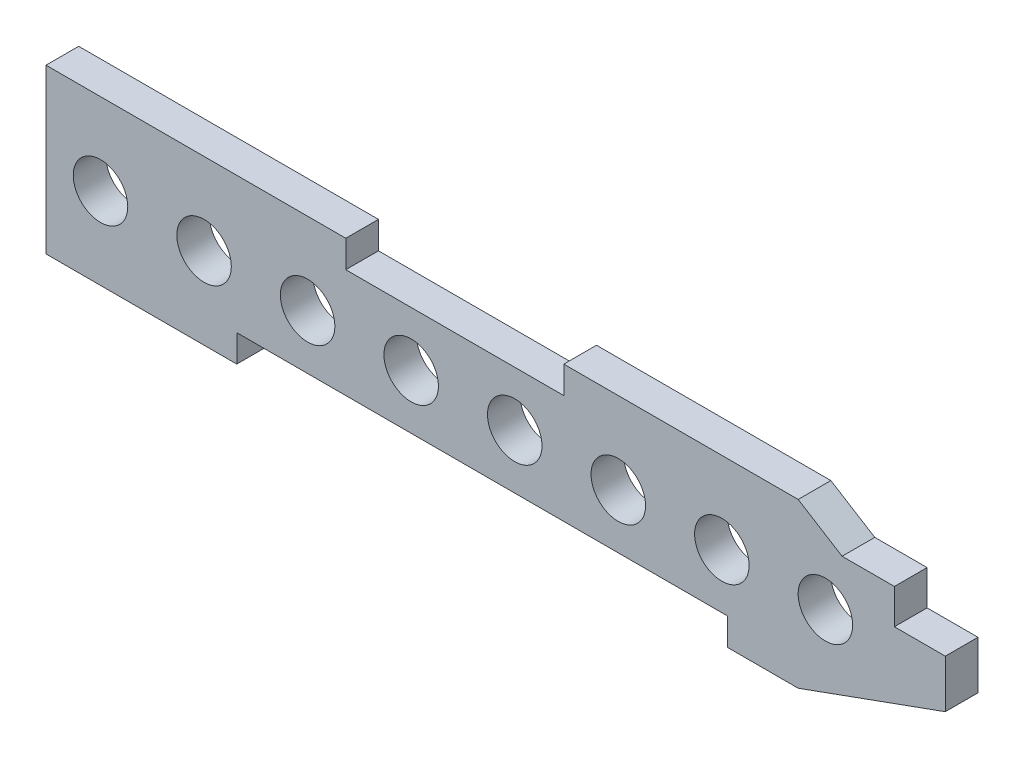
ISO-10303-21;
HEADER;
FILE_DESCRIPTION(('STEP AP214'),'2;1');
FILE_NAME('part.step','',(''),(''),'','','');
FILE_SCHEMA(('AUTOMOTIVE_DESIGN { 1 0 10303 214 1 1 1 1 }'));
ENDSEC;
DATA;
#1=APPLICATION_CONTEXT('core data for automotive mechanical design processes');
#2=APPLICATION_PROTOCOL_DEFINITION('international standard','automotive_design',2000,#1);
#3=PRODUCT_CONTEXT('',#1,'mechanical');
#4=PRODUCT('Part','Part','',(#3));
#5=PRODUCT_RELATED_PRODUCT_CATEGORY('part','',(#4));
#6=PRODUCT_DEFINITION_FORMATION('','',#4);
#7=PRODUCT_DEFINITION_CONTEXT('part definition',#1,'design');
#8=PRODUCT_DEFINITION('design','',#6,#7);
#9=PRODUCT_DEFINITION_SHAPE('','',#8);
#10=(LENGTH_UNIT() NAMED_UNIT(*) SI_UNIT(.MILLI.,.METRE.));
#11=(NAMED_UNIT(*) PLANE_ANGLE_UNIT() SI_UNIT($,.RADIAN.));
#12=(NAMED_UNIT(*) SI_UNIT($,.STERADIAN.) SOLID_ANGLE_UNIT());
#13=UNCERTAINTY_MEASURE_WITH_UNIT(LENGTH_MEASURE(1.E-05),#10,'distance_accuracy_value','');
#14=(GEOMETRIC_REPRESENTATION_CONTEXT(3) GLOBAL_UNCERTAINTY_ASSIGNED_CONTEXT((#13)) GLOBAL_UNIT_ASSIGNED_CONTEXT((#10,
#11,#12)) REPRESENTATION_CONTEXT('',''));
#15=CARTESIAN_POINT('',(0.,0.,0.));
#16=DIRECTION('',(0.,0.,1.));
#17=DIRECTION('',(1.,0.,0.));
#18=AXIS2_PLACEMENT_3D('',#15,#16,#17);
#19=CARTESIAN_POINT('',(0.,0.,12.));
#20=DIRECTION('',(0.,0.,1.));
#21=DIRECTION('',(1.,0.,0.));
#22=AXIS2_PLACEMENT_3D('',#19,#20,#21);
#23=PLANE('',#22);
#24=CARTESIAN_POINT('',(50.196997967068,5.87576447779662,12.));
#25=DIRECTION('',(0.,0.,1.));
#26=DIRECTION('',(1.,0.,0.));
#27=AXIS2_PLACEMENT_3D('',#24,#25,#26);
#28=CIRCLE('',#27,10.);
#29=CARTESIAN_POINT('',(60.196997967068,5.87576447779662,12.));
#30=VERTEX_POINT('',#29);
#31=EDGE_CURVE('E428',#30,#30,#28,.T.);
#32=ORIENTED_EDGE('',*,*,#31,.F.);
#33=EDGE_LOOP('',(#32));
#34=FACE_BOUND('',#33,.T.);
#35=CARTESIAN_POINT('',(-25.803002032932,5.87576447779662,12.));
#36=DIRECTION('',(0.,0.,1.));
#37=DIRECTION('',(1.,0.,0.));
#38=AXIS2_PLACEMENT_3D('',#35,#36,#37);
#39=CIRCLE('',#38,10.);
#40=CARTESIAN_POINT('',(-15.8030020329319,5.87576447779662,12.));
#41=VERTEX_POINT('',#40);
#42=EDGE_CURVE('E444',#41,#41,#39,.T.);
#43=ORIENTED_EDGE('',*,*,#42,.F.);
#44=EDGE_LOOP('',(#43));
#45=FACE_BOUND('',#44,.T.);
#46=CARTESIAN_POINT('',(-101.803002032932,5.87576447779662,12.));
#47=DIRECTION('',(0.,0.,1.));
#48=DIRECTION('',(1.,0.,0.));
#49=AXIS2_PLACEMENT_3D('',#46,#47,#48);
#50=CIRCLE('',#49,10.);
#51=CARTESIAN_POINT('',(-91.8030020329319,5.87576447779662,12.));
#52=VERTEX_POINT('',#51);
#53=EDGE_CURVE('E460',#52,#52,#50,.T.);
#54=ORIENTED_EDGE('',*,*,#53,.F.);
#55=EDGE_LOOP('',(#54));
#56=FACE_BOUND('',#55,.T.);
#57=CARTESIAN_POINT('',(-177.803002032932,5.87576447779662,12.));
#58=DIRECTION('',(0.,0.,1.));
#59=DIRECTION('',(1.,0.,0.));
#60=AXIS2_PLACEMENT_3D('',#57,#58,#59);
#61=CIRCLE('',#60,10.);
#62=CARTESIAN_POINT('',(-167.803002032932,5.87576447779662,12.));
#63=VERTEX_POINT('',#62);
#64=EDGE_CURVE('E200',#63,#63,#61,.T.);
#65=ORIENTED_EDGE('',*,*,#64,.F.);
#66=EDGE_LOOP('',(#65));
#67=FACE_BOUND('',#66,.T.);
#68=DIRECTION('',(1.,0.,0.));
#69=VECTOR('',#68,1.);
#70=CARTESIAN_POINT('',(-197.803002032932,-24.1242355222034,12.));
#71=LINE('',#70,#69);
#72=CARTESIAN_POINT('',(-197.803002032932,-24.1242355222034,12.));
#73=VERTEX_POINT('',#72);
#74=CARTESIAN_POINT('',(-127.803002032932,-24.1242355222034,12.));
#75=VERTEX_POINT('',#74);
#76=EDGE_CURVE('E245',#73,#75,#71,.T.);
#77=ORIENTED_EDGE('',*,*,#76,.T.);
#78=DIRECTION('',(0.,1.,0.));
#79=VECTOR('',#78,1.);
#80=CARTESIAN_POINT('',(-127.803002032932,-24.1242355222034,12.));
#81=LINE('',#80,#79);
#82=CARTESIAN_POINT('',(-127.803002032932,-14.1242355222034,12.));
#83=VERTEX_POINT('',#82);
#84=EDGE_CURVE('E127',#75,#83,#81,.T.);
#85=ORIENTED_EDGE('',*,*,#84,.T.);
#86=DIRECTION('',(1.,0.,0.));
#87=VECTOR('',#86,1.);
#88=CARTESIAN_POINT('',(-127.803002032932,-14.1242355222034,12.));
#89=LINE('',#88,#87);
#90=CARTESIAN_POINT('',(52.1969979670681,-14.1242355222034,12.));
#91=VERTEX_POINT('',#90);
#92=EDGE_CURVE('E302',#83,#91,#89,.T.);
#93=ORIENTED_EDGE('',*,*,#92,.T.);
#94=DIRECTION('',(0.,-1.,0.));
#95=VECTOR('',#94,1.);
#96=CARTESIAN_POINT('',(52.1969979670681,-14.1242355222034,12.));
#97=LINE('',#96,#95);
#98=CARTESIAN_POINT('',(52.1969979670681,-24.1242355222034,12.));
#99=VERTEX_POINT('',#98);
#100=EDGE_CURVE('E322',#91,#99,#97,.T.);
#101=ORIENTED_EDGE('',*,*,#100,.T.);
#102=DIRECTION('',(1.,0.,0.));
#103=VECTOR('',#102,1.);
#104=CARTESIAN_POINT('',(52.1969979670681,-24.1242355222034,12.));
#105=LINE('',#104,#103);
#106=CARTESIAN_POINT('',(78.2069979670681,-24.1242355222034,12.));
#107=VERTEX_POINT('',#106);
#108=EDGE_CURVE('E318',#99,#107,#105,.T.);
#109=ORIENTED_EDGE('',*,*,#108,.T.);
#110=DIRECTION('',(0.940366742720057,0.340162298301958,0.));
#111=VECTOR('',#110,1.);
#112=CARTESIAN_POINT('',(78.2069979670681,-24.1242355222034,12.));
#113=LINE('',#112,#111);
#114=CARTESIAN_POINT('',(132.196997967068,-4.59423552220335,12.));
#115=VERTEX_POINT('',#114);
#116=EDGE_CURVE('E321',#107,#115,#113,.T.);
#117=ORIENTED_EDGE('',*,*,#116,.T.);
#118=DIRECTION('',(0.,1.,0.));
#119=VECTOR('',#118,1.);
#120=CARTESIAN_POINT('',(132.196997967068,-4.59423552220335,12.));
#121=LINE('',#120,#119);
#122=CARTESIAN_POINT('',(132.196997967068,13.0657644777966,12.));
#123=VERTEX_POINT('',#122);
#124=EDGE_CURVE('E326',#115,#123,#121,.T.);
#125=ORIENTED_EDGE('',*,*,#124,.T.);
#126=DIRECTION('',(-1.,0.,0.));
#127=VECTOR('',#126,1.);
#128=CARTESIAN_POINT('',(132.196997967068,13.0657644777966,12.));
#129=LINE('',#128,#127);
#130=CARTESIAN_POINT('',(113.516997967068,13.0657644777966,12.));
#131=VERTEX_POINT('',#130);
#132=EDGE_CURVE('E333',#123,#131,#129,.T.);
#133=ORIENTED_EDGE('',*,*,#132,.T.);
#134=DIRECTION('',(0.,1.,0.));
#135=VECTOR('',#134,1.);
#136=CARTESIAN_POINT('',(113.516997967068,13.0657644777966,12.));
#137=LINE('',#136,#135);
#138=CARTESIAN_POINT('',(113.516997967068,25.8757644777966,12.));
#139=VERTEX_POINT('',#138);
#140=EDGE_CURVE('E336',#131,#139,#137,.T.);
#141=ORIENTED_EDGE('',*,*,#140,.T.);
#142=DIRECTION('',(-1.,0.,0.));
#143=VECTOR('',#142,1.);
#144=CARTESIAN_POINT('',(113.516997967068,25.8757644777966,12.));
#145=LINE('',#144,#143);
#146=CARTESIAN_POINT('',(94.3169979670681,25.8757644777966,12.));
#147=VERTEX_POINT('',#146);
#148=EDGE_CURVE('E339',#139,#147,#145,.T.);
#149=ORIENTED_EDGE('',*,*,#148,.T.);
#150=DIRECTION('',(-0.849623868789641,0.52738911780859,0.));
#151=VECTOR('',#150,1.);
#152=CARTESIAN_POINT('',(94.3169979670681,25.8757644777966,12.));
#153=LINE('',#152,#151);
#154=CARTESIAN_POINT('',(78.206997967068,35.8757644777966,12.));
#155=VERTEX_POINT('',#154);
#156=EDGE_CURVE('E342',#147,#155,#153,.T.);
#157=ORIENTED_EDGE('',*,*,#156,.T.);
#158=DIRECTION('',(-1.,0.,0.));
#159=VECTOR('',#158,1.);
#160=CARTESIAN_POINT('',(78.206997967068,35.8757644777966,12.));
#161=LINE('',#160,#159);
#162=CARTESIAN_POINT('',(-7.80300203293197,35.8757644777966,12.));
#163=VERTEX_POINT('',#162);
#164=EDGE_CURVE('E345',#155,#163,#161,.T.);
#165=ORIENTED_EDGE('',*,*,#164,.T.);
#166=DIRECTION('',(0.,-1.,0.));
#167=VECTOR('',#166,1.);
#168=CARTESIAN_POINT('',(-7.80300203293197,35.8757644777966,12.));
#169=LINE('',#168,#167);
#170=CARTESIAN_POINT('',(-7.80300203293197,25.8757644777966,12.));
#171=VERTEX_POINT('',#170);
#172=EDGE_CURVE('E348',#163,#171,#169,.T.);
#173=ORIENTED_EDGE('',*,*,#172,.T.);
#174=DIRECTION('',(-1.,0.,0.));
#175=VECTOR('',#174,1.);
#176=CARTESIAN_POINT('',(-7.80300203293197,25.8757644777966,12.));
#177=LINE('',#176,#175);
#178=CARTESIAN_POINT('',(-87.803002032932,25.8757644777966,12.));
#179=VERTEX_POINT('',#178);
#180=EDGE_CURVE('E173',#171,#179,#177,.T.);
#181=ORIENTED_EDGE('',*,*,#180,.T.);
#182=DIRECTION('',(0.,1.,0.));
#183=VECTOR('',#182,1.);
#184=CARTESIAN_POINT('',(-87.803002032932,25.8757644777966,12.));
#185=LINE('',#184,#183);
#186=CARTESIAN_POINT('',(-87.803002032932,35.8757644777966,12.));
#187=VERTEX_POINT('',#186);
#188=EDGE_CURVE('E167',#179,#187,#185,.T.);
#189=ORIENTED_EDGE('',*,*,#188,.T.);
#190=DIRECTION('',(-1.,0.,0.));
#191=VECTOR('',#190,1.);
#192=CARTESIAN_POINT('',(-87.803002032932,35.8757644777966,12.));
#193=LINE('',#192,#191);
#194=CARTESIAN_POINT('',(-197.803002032932,35.8757644777966,12.));
#195=VERTEX_POINT('',#194);
#196=EDGE_CURVE('E171',#187,#195,#193,.T.);
#197=ORIENTED_EDGE('',*,*,#196,.T.);
#198=DIRECTION('',(0.,-1.,0.));
#199=VECTOR('',#198,1.);
#200=CARTESIAN_POINT('',(-197.803002032932,35.8757644777966,12.));
#201=LINE('',#200,#199);
#202=EDGE_CURVE('E57',#195,#73,#201,.T.);
#203=ORIENTED_EDGE('',*,*,#202,.T.);
#204=EDGE_LOOP('',(#77,#85,#93,#101,#109,#117,#125,#133,#141,#149,#157,#165,#173,#181,#189,#197,#203));
#205=FACE_BOUND('',#204,.T.);
#206=CARTESIAN_POINT('',(-139.803002032932,5.87576447779662,12.));
#207=DIRECTION('',(0.,0.,1.));
#208=DIRECTION('',(1.,0.,0.));
#209=AXIS2_PLACEMENT_3D('',#206,#207,#208);
#210=CIRCLE('',#209,10.);
#211=CARTESIAN_POINT('',(-129.803002032932,5.87576447779662,12.));
#212=VERTEX_POINT('',#211);
#213=EDGE_CURVE('E468',#212,#212,#210,.T.);
#214=ORIENTED_EDGE('',*,*,#213,.F.);
#215=EDGE_LOOP('',(#214));
#216=FACE_BOUND('',#215,.T.);
#217=CARTESIAN_POINT('',(-63.803002032932,5.87576447779662,12.));
#218=DIRECTION('',(0.,0.,1.));
#219=DIRECTION('',(1.,0.,0.));
#220=AXIS2_PLACEMENT_3D('',#217,#218,#219);
#221=CIRCLE('',#220,10.);
#222=CARTESIAN_POINT('',(-53.8030020329319,5.87576447779662,12.));
#223=VERTEX_POINT('',#222);
#224=EDGE_CURVE('E452',#223,#223,#221,.T.);
#225=ORIENTED_EDGE('',*,*,#224,.F.);
#226=EDGE_LOOP('',(#225));
#227=FACE_BOUND('',#226,.T.);
#228=CARTESIAN_POINT('',(12.1969979670681,5.87576447779662,12.));
#229=DIRECTION('',(0.,0.,1.));
#230=DIRECTION('',(1.,0.,0.));
#231=AXIS2_PLACEMENT_3D('',#228,#229,#230);
#232=CIRCLE('',#231,10.);
#233=CARTESIAN_POINT('',(22.1969979670681,5.87576447779662,12.));
#234=VERTEX_POINT('',#233);
#235=EDGE_CURVE('E436',#234,#234,#232,.T.);
#236=ORIENTED_EDGE('',*,*,#235,.F.);
#237=EDGE_LOOP('',(#236));
#238=FACE_BOUND('',#237,.T.);
#239=CARTESIAN_POINT('',(88.1969979670681,5.87576447779662,12.));
#240=DIRECTION('',(0.,0.,1.));
#241=DIRECTION('',(1.,0.,0.));
#242=AXIS2_PLACEMENT_3D('',#239,#240,#241);
#243=CIRCLE('',#242,10.);
#244=CARTESIAN_POINT('',(98.1969979670681,5.87576447779662,12.));
#245=VERTEX_POINT('',#244);
#246=EDGE_CURVE('E417',#245,#245,#243,.T.);
#247=ORIENTED_EDGE('',*,*,#246,.F.);
#248=EDGE_LOOP('',(#247));
#249=FACE_BOUND('',#248,.T.);
#250=ADVANCED_FACE('F39',(#34,#45,#56,#67,#205,#216,#227,#238,#249),#23,.T.);
#251=CARTESIAN_POINT('',(0.,0.,0.));
#252=DIRECTION('',(0.,0.,1.));
#253=DIRECTION('',(1.,0.,0.));
#254=AXIS2_PLACEMENT_3D('',#251,#252,#253);
#255=PLANE('',#254);
#256=DIRECTION('',(1.,0.,0.));
#257=VECTOR('',#256,1.);
#258=CARTESIAN_POINT('',(-197.803002032932,-24.1242355222034,0.));
#259=LINE('',#258,#257);
#260=CARTESIAN_POINT('',(-197.803002032932,-24.1242355222034,0.));
#261=VERTEX_POINT('',#260);
#262=CARTESIAN_POINT('',(-127.803002032932,-24.1242355222034,0.));
#263=VERTEX_POINT('',#262);
#264=EDGE_CURVE('E195',#261,#263,#259,.T.);
#265=ORIENTED_EDGE('',*,*,#264,.F.);
#266=DIRECTION('',(0.,-1.,0.));
#267=VECTOR('',#266,1.);
#268=CARTESIAN_POINT('',(-197.803002032932,35.8757644777966,0.));
#269=LINE('',#268,#267);
#270=CARTESIAN_POINT('',(-197.803002032932,35.8757644777966,0.));
#271=VERTEX_POINT('',#270);
#272=EDGE_CURVE('E119',#271,#261,#269,.T.);
#273=ORIENTED_EDGE('',*,*,#272,.F.);
#274=DIRECTION('',(-1.,0.,0.));
#275=VECTOR('',#274,1.);
#276=CARTESIAN_POINT('',(-87.803002032932,35.8757644777966,0.));
#277=LINE('',#276,#275);
#278=CARTESIAN_POINT('',(-87.803002032932,35.8757644777966,0.));
#279=VERTEX_POINT('',#278);
#280=EDGE_CURVE('E113',#279,#271,#277,.T.);
#281=ORIENTED_EDGE('',*,*,#280,.F.);
#282=DIRECTION('',(0.,1.,0.));
#283=VECTOR('',#282,1.);
#284=CARTESIAN_POINT('',(-87.803002032932,25.8757644777966,0.));
#285=LINE('',#284,#283);
#286=CARTESIAN_POINT('',(-87.803002032932,25.8757644777966,0.));
#287=VERTEX_POINT('',#286);
#288=EDGE_CURVE('E182',#287,#279,#285,.T.);
#289=ORIENTED_EDGE('',*,*,#288,.F.);
#290=DIRECTION('',(-1.,0.,0.));
#291=VECTOR('',#290,1.);
#292=CARTESIAN_POINT('',(-7.80300203293197,25.8757644777966,0.));
#293=LINE('',#292,#291);
#294=CARTESIAN_POINT('',(-7.80300203293197,25.8757644777966,0.));
#295=VERTEX_POINT('',#294);
#296=EDGE_CURVE('E236',#295,#287,#293,.T.);
#297=ORIENTED_EDGE('',*,*,#296,.F.);
#298=DIRECTION('',(0.,-1.,0.));
#299=VECTOR('',#298,1.);
#300=CARTESIAN_POINT('',(-7.80300203293197,35.8757644777966,0.));
#301=LINE('',#300,#299);
#302=CARTESIAN_POINT('',(-7.80300203293197,35.8757644777966,0.));
#303=VERTEX_POINT('',#302);
#304=EDGE_CURVE('E233',#303,#295,#301,.T.);
#305=ORIENTED_EDGE('',*,*,#304,.F.);
#306=DIRECTION('',(-1.,0.,0.));
#307=VECTOR('',#306,1.);
#308=CARTESIAN_POINT('',(78.206997967068,35.8757644777966,0.));
#309=LINE('',#308,#307);
#310=CARTESIAN_POINT('',(78.206997967068,35.8757644777966,0.));
#311=VERTEX_POINT('',#310);
#312=EDGE_CURVE('E230',#311,#303,#309,.T.);
#313=ORIENTED_EDGE('',*,*,#312,.F.);
#314=DIRECTION('',(-0.849623868789641,0.52738911780859,0.));
#315=VECTOR('',#314,1.);
#316=CARTESIAN_POINT('',(94.3169979670681,25.8757644777966,0.));
#317=LINE('',#316,#315);
#318=CARTESIAN_POINT('',(94.3169979670681,25.8757644777966,0.));
#319=VERTEX_POINT('',#318);
#320=EDGE_CURVE('E227',#319,#311,#317,.T.);
#321=ORIENTED_EDGE('',*,*,#320,.F.);
#322=DIRECTION('',(-1.,0.,0.));
#323=VECTOR('',#322,1.);
#324=CARTESIAN_POINT('',(113.516997967068,25.8757644777966,0.));
#325=LINE('',#324,#323);
#326=CARTESIAN_POINT('',(113.516997967068,25.8757644777966,0.));
#327=VERTEX_POINT('',#326);
#328=EDGE_CURVE('E224',#327,#319,#325,.T.);
#329=ORIENTED_EDGE('',*,*,#328,.F.);
#330=DIRECTION('',(0.,1.,0.));
#331=VECTOR('',#330,1.);
#332=CARTESIAN_POINT('',(113.516997967068,13.0657644777966,0.));
#333=LINE('',#332,#331);
#334=CARTESIAN_POINT('',(113.516997967068,13.0657644777966,0.));
#335=VERTEX_POINT('',#334);
#336=EDGE_CURVE('E221',#335,#327,#333,.T.);
#337=ORIENTED_EDGE('',*,*,#336,.F.);
#338=DIRECTION('',(-1.,0.,0.));
#339=VECTOR('',#338,1.);
#340=CARTESIAN_POINT('',(132.196997967068,13.0657644777966,0.));
#341=LINE('',#340,#339);
#342=CARTESIAN_POINT('',(132.196997967068,13.0657644777966,0.));
#343=VERTEX_POINT('',#342);
#344=EDGE_CURVE('E218',#343,#335,#341,.T.);
#345=ORIENTED_EDGE('',*,*,#344,.F.);
#346=DIRECTION('',(0.,1.,0.));
#347=VECTOR('',#346,1.);
#348=CARTESIAN_POINT('',(132.196997967068,-4.59423552220335,0.));
#349=LINE('',#348,#347);
#350=CARTESIAN_POINT('',(132.196997967068,-4.59423552220335,0.));
#351=VERTEX_POINT('',#350);
#352=EDGE_CURVE('E215',#351,#343,#349,.T.);
#353=ORIENTED_EDGE('',*,*,#352,.F.);
#354=DIRECTION('',(0.940366742720057,0.340162298301958,0.));
#355=VECTOR('',#354,1.);
#356=CARTESIAN_POINT('',(78.2069979670681,-24.1242355222034,0.));
#357=LINE('',#356,#355);
#358=CARTESIAN_POINT('',(78.2069979670681,-24.1242355222034,0.));
#359=VERTEX_POINT('',#358);
#360=EDGE_CURVE('E212',#359,#351,#357,.T.);
#361=ORIENTED_EDGE('',*,*,#360,.F.);
#362=DIRECTION('',(1.,0.,0.));
#363=VECTOR('',#362,1.);
#364=CARTESIAN_POINT('',(52.1969979670681,-24.1242355222034,0.));
#365=LINE('',#364,#363);
#366=CARTESIAN_POINT('',(52.1969979670681,-24.1242355222034,0.));
#367=VERTEX_POINT('',#366);
#368=EDGE_CURVE('E209',#367,#359,#365,.T.);
#369=ORIENTED_EDGE('',*,*,#368,.F.);
#370=DIRECTION('',(0.,-1.,0.));
#371=VECTOR('',#370,1.);
#372=CARTESIAN_POINT('',(52.1969979670681,-14.1242355222034,0.));
#373=LINE('',#372,#371);
#374=CARTESIAN_POINT('',(52.1969979670681,-14.1242355222034,0.));
#375=VERTEX_POINT('',#374);
#376=EDGE_CURVE('E206',#375,#367,#373,.T.);
#377=ORIENTED_EDGE('',*,*,#376,.F.);
#378=DIRECTION('',(1.,0.,0.));
#379=VECTOR('',#378,1.);
#380=CARTESIAN_POINT('',(-127.803002032932,-14.1242355222034,0.));
#381=LINE('',#380,#379);
#382=CARTESIAN_POINT('',(-127.803002032932,-14.1242355222034,0.));
#383=VERTEX_POINT('',#382);
#384=EDGE_CURVE('E203',#383,#375,#381,.T.);
#385=ORIENTED_EDGE('',*,*,#384,.F.);
#386=DIRECTION('',(0.,1.,0.));
#387=VECTOR('',#386,1.);
#388=CARTESIAN_POINT('',(-127.803002032932,-24.1242355222034,0.));
#389=LINE('',#388,#387);
#390=EDGE_CURVE('E199',#263,#383,#389,.T.);
#391=ORIENTED_EDGE('',*,*,#390,.F.);
#392=EDGE_LOOP('',(#265,#273,#281,#289,#297,#305,#313,#321,#329,#337,#345,#353,#361,#369,#377,
#385,#391));
#393=FACE_BOUND('',#392,.T.);
#394=CARTESIAN_POINT('',(-177.803002032932,5.87576447779662,0.));
#395=DIRECTION('',(0.,0.,1.));
#396=DIRECTION('',(1.,0.,0.));
#397=AXIS2_PLACEMENT_3D('',#394,#395,#396);
#398=CIRCLE('',#397,10.);
#399=CARTESIAN_POINT('',(-167.803002032932,5.87576447779662,0.));
#400=VERTEX_POINT('',#399);
#401=EDGE_CURVE('E472',#400,#400,#398,.T.);
#402=ORIENTED_EDGE('',*,*,#401,.T.);
#403=EDGE_LOOP('',(#402));
#404=FACE_BOUND('',#403,.T.);
#405=CARTESIAN_POINT('',(-139.803002032932,5.87576447779662,0.));
#406=DIRECTION('',(0.,0.,1.));
#407=DIRECTION('',(1.,0.,0.));
#408=AXIS2_PLACEMENT_3D('',#405,#406,#407);
#409=CIRCLE('',#408,10.);
#410=CARTESIAN_POINT('',(-129.803002032932,5.87576447779662,0.));
#411=VERTEX_POINT('',#410);
#412=EDGE_CURVE('E464',#411,#411,#409,.T.);
#413=ORIENTED_EDGE('',*,*,#412,.T.);
#414=EDGE_LOOP('',(#413));
#415=FACE_BOUND('',#414,.T.);
#416=CARTESIAN_POINT('',(-101.803002032932,5.87576447779662,0.));
#417=DIRECTION('',(0.,0.,1.));
#418=DIRECTION('',(1.,0.,0.));
#419=AXIS2_PLACEMENT_3D('',#416,#417,#418);
#420=CIRCLE('',#419,10.);
#421=CARTESIAN_POINT('',(-91.8030020329319,5.87576447779662,0.));
#422=VERTEX_POINT('',#421);
#423=EDGE_CURVE('E456',#422,#422,#420,.T.);
#424=ORIENTED_EDGE('',*,*,#423,.T.);
#425=EDGE_LOOP('',(#424));
#426=FACE_BOUND('',#425,.T.);
#427=CARTESIAN_POINT('',(-63.803002032932,5.87576447779662,0.));
#428=DIRECTION('',(0.,0.,1.));
#429=DIRECTION('',(1.,0.,0.));
#430=AXIS2_PLACEMENT_3D('',#427,#428,#429);
#431=CIRCLE('',#430,10.);
#432=CARTESIAN_POINT('',(-53.8030020329319,5.87576447779662,0.));
#433=VERTEX_POINT('',#432);
#434=EDGE_CURVE('E448',#433,#433,#431,.T.);
#435=ORIENTED_EDGE('',*,*,#434,.T.);
#436=EDGE_LOOP('',(#435));
#437=FACE_BOUND('',#436,.T.);
#438=CARTESIAN_POINT('',(-25.803002032932,5.87576447779662,0.));
#439=DIRECTION('',(0.,0.,1.));
#440=DIRECTION('',(1.,0.,0.));
#441=AXIS2_PLACEMENT_3D('',#438,#439,#440);
#442=CIRCLE('',#441,10.);
#443=CARTESIAN_POINT('',(-15.8030020329319,5.87576447779662,0.));
#444=VERTEX_POINT('',#443);
#445=EDGE_CURVE('E440',#444,#444,#442,.T.);
#446=ORIENTED_EDGE('',*,*,#445,.T.);
#447=EDGE_LOOP('',(#446));
#448=FACE_BOUND('',#447,.T.);
#449=CARTESIAN_POINT('',(12.1969979670681,5.87576447779662,0.));
#450=DIRECTION('',(0.,0.,1.));
#451=DIRECTION('',(1.,0.,0.));
#452=AXIS2_PLACEMENT_3D('',#449,#450,#451);
#453=CIRCLE('',#452,10.);
#454=CARTESIAN_POINT('',(22.1969979670681,5.87576447779662,0.));
#455=VERTEX_POINT('',#454);
#456=EDGE_CURVE('E432',#455,#455,#453,.T.);
#457=ORIENTED_EDGE('',*,*,#456,.T.);
#458=EDGE_LOOP('',(#457));
#459=FACE_BOUND('',#458,.T.);
#460=CARTESIAN_POINT('',(50.196997967068,5.87576447779662,0.));
#461=DIRECTION('',(0.,0.,1.));
#462=DIRECTION('',(1.,0.,0.));
#463=AXIS2_PLACEMENT_3D('',#460,#461,#462);
#464=CIRCLE('',#463,10.);
#465=CARTESIAN_POINT('',(60.196997967068,5.87576447779662,0.));
#466=VERTEX_POINT('',#465);
#467=EDGE_CURVE('E425',#466,#466,#464,.T.);
#468=ORIENTED_EDGE('',*,*,#467,.T.);
#469=EDGE_LOOP('',(#468));
#470=FACE_BOUND('',#469,.T.);
#471=CARTESIAN_POINT('',(88.1969979670681,5.87576447779662,0.));
#472=DIRECTION('',(0.,0.,1.));
#473=DIRECTION('',(1.,0.,0.));
#474=AXIS2_PLACEMENT_3D('',#471,#472,#473);
#475=CIRCLE('',#474,10.);
#476=CARTESIAN_POINT('',(98.1969979670681,5.87576447779662,0.));
#477=VERTEX_POINT('',#476);
#478=EDGE_CURVE('E420',#477,#477,#475,.T.);
#479=ORIENTED_EDGE('',*,*,#478,.T.);
#480=EDGE_LOOP('',(#479));
#481=FACE_BOUND('',#480,.T.);
#482=ADVANCED_FACE('F306',(#393,#404,#415,#426,#437,#448,#459,#470,#481),#255,.F.);
#483=CARTESIAN_POINT('',(-197.803002032932,-24.1242355222034,12.));
#484=DIRECTION('',(0.,1.,0.));
#485=DIRECTION('',(-1.,0.,0.));
#486=AXIS2_PLACEMENT_3D('',#483,#484,#485);
#487=PLANE('',#486);
#488=ORIENTED_EDGE('',*,*,#264,.T.);
#489=DIRECTION('',(0.,0.,-1.));
#490=VECTOR('',#489,1.);
#491=CARTESIAN_POINT('',(-127.803002032932,-24.1242355222034,12.));
#492=LINE('',#491,#490);
#493=EDGE_CURVE('E11',#75,#263,#492,.T.);
#494=ORIENTED_EDGE('',*,*,#493,.F.);
#495=ORIENTED_EDGE('',*,*,#76,.F.);
#496=DIRECTION('',(0.,0.,-1.));
#497=VECTOR('',#496,1.);
#498=CARTESIAN_POINT('',(-197.803002032932,-24.1242355222034,12.));
#499=LINE('',#498,#497);
#500=EDGE_CURVE('E191',#73,#261,#499,.T.);
#501=ORIENTED_EDGE('',*,*,#500,.T.);
#502=EDGE_LOOP('',(#488,#494,#495,#501));
#503=FACE_BOUND('',#502,.T.);
#504=ADVANCED_FACE('F41',(#503),#487,.F.);
#505=CARTESIAN_POINT('',(-127.803002032932,-24.1242355222034,12.));
#506=DIRECTION('',(-1.,0.,0.));
#507=DIRECTION('',(0.,0.,1.));
#508=AXIS2_PLACEMENT_3D('',#505,#506,#507);
#509=PLANE('',#508);
#510=ORIENTED_EDGE('',*,*,#390,.T.);
#511=DIRECTION('',(0.,0.,-1.));
#512=VECTOR('',#511,1.);
#513=CARTESIAN_POINT('',(-127.803002032932,-14.1242355222034,12.));
#514=LINE('',#513,#512);
#515=EDGE_CURVE('E49',#83,#383,#514,.T.);
#516=ORIENTED_EDGE('',*,*,#515,.F.);
#517=ORIENTED_EDGE('',*,*,#84,.F.);
#518=ORIENTED_EDGE('',*,*,#493,.T.);
#519=EDGE_LOOP('',(#510,#516,#517,#518));
#520=FACE_BOUND('',#519,.T.);
#521=ADVANCED_FACE('F674',(#520),#509,.F.);
#522=CARTESIAN_POINT('',(-127.803002032932,-14.1242355222034,12.));
#523=DIRECTION('',(0.,1.,0.));
#524=DIRECTION('',(-1.,0.,0.));
#525=AXIS2_PLACEMENT_3D('',#522,#523,#524);
#526=PLANE('',#525);
#527=ORIENTED_EDGE('',*,*,#384,.T.);
#528=DIRECTION('',(0.,0.,-1.));
#529=VECTOR('',#528,1.);
#530=CARTESIAN_POINT('',(52.1969979670681,-14.1242355222034,12.));
#531=LINE('',#530,#529);
#532=EDGE_CURVE('E292',#91,#375,#531,.T.);
#533=ORIENTED_EDGE('',*,*,#532,.F.);
#534=ORIENTED_EDGE('',*,*,#92,.F.);
#535=ORIENTED_EDGE('',*,*,#515,.T.);
#536=EDGE_LOOP('',(#527,#533,#534,#535));
#537=FACE_BOUND('',#536,.T.);
#538=ADVANCED_FACE('F300',(#537),#526,.F.);
#539=CARTESIAN_POINT('',(52.1969979670681,-14.1242355222034,12.));
#540=DIRECTION('',(1.,0.,0.));
#541=DIRECTION('',(0.,0.,-1.));
#542=AXIS2_PLACEMENT_3D('',#539,#540,#541);
#543=PLANE('',#542);
#544=ORIENTED_EDGE('',*,*,#376,.T.);
#545=DIRECTION('',(0.,0.,-1.));
#546=VECTOR('',#545,1.);
#547=CARTESIAN_POINT('',(52.1969979670681,-24.1242355222034,12.));
#548=LINE('',#547,#546);
#549=EDGE_CURVE('E288',#99,#367,#548,.T.);
#550=ORIENTED_EDGE('',*,*,#549,.F.);
#551=ORIENTED_EDGE('',*,*,#100,.F.);
#552=ORIENTED_EDGE('',*,*,#532,.T.);
#553=EDGE_LOOP('',(#544,#550,#551,#552));
#554=FACE_BOUND('',#553,.T.);
#555=ADVANCED_FACE('F312',(#554),#543,.F.);
#556=CARTESIAN_POINT('',(52.1969979670681,-24.1242355222034,12.));
#557=DIRECTION('',(0.,1.,0.));
#558=DIRECTION('',(0.,0.,1.));
#559=AXIS2_PLACEMENT_3D('',#556,#557,#558);
#560=PLANE('',#559);
#561=ORIENTED_EDGE('',*,*,#368,.T.);
#562=DIRECTION('',(0.,0.,-1.));
#563=VECTOR('',#562,1.);
#564=CARTESIAN_POINT('',(78.2069979670681,-24.1242355222034,12.));
#565=LINE('',#564,#563);
#566=EDGE_CURVE('E284',#107,#359,#565,.T.);
#567=ORIENTED_EDGE('',*,*,#566,.F.);
#568=ORIENTED_EDGE('',*,*,#108,.F.);
#569=ORIENTED_EDGE('',*,*,#549,.T.);
#570=EDGE_LOOP('',(#561,#567,#568,#569));
#571=FACE_BOUND('',#570,.T.);
#572=ADVANCED_FACE('F316',(#571),#560,.F.);
#573=CARTESIAN_POINT('',(78.2069979670681,-24.1242355222034,12.));
#574=DIRECTION('',(-0.340162298301958,0.940366742720057,0.));
#575=DIRECTION('',(-0.940366742720057,-0.340162298301958,0.));
#576=AXIS2_PLACEMENT_3D('',#573,#574,#575);
#577=PLANE('',#576);
#578=ORIENTED_EDGE('',*,*,#360,.T.);
#579=DIRECTION('',(0.,0.,-1.));
#580=VECTOR('',#579,1.);
#581=CARTESIAN_POINT('',(132.196997967068,-4.59423552220335,12.));
#582=LINE('',#581,#580);
#583=EDGE_CURVE('E280',#115,#351,#582,.T.);
#584=ORIENTED_EDGE('',*,*,#583,.F.);
#585=ORIENTED_EDGE('',*,*,#116,.F.);
#586=ORIENTED_EDGE('',*,*,#566,.T.);
#587=EDGE_LOOP('',(#578,#584,#585,#586));
#588=FACE_BOUND('',#587,.T.);
#589=ADVANCED_FACE('F639',(#588),#577,.F.);
#590=CARTESIAN_POINT('',(132.196997967068,-4.59423552220335,12.));
#591=DIRECTION('',(-1.,0.,0.));
#592=DIRECTION('',(0.,0.,1.));
#593=AXIS2_PLACEMENT_3D('',#590,#591,#592);
#594=PLANE('',#593);
#595=ORIENTED_EDGE('',*,*,#352,.T.);
#596=DIRECTION('',(0.,0.,-1.));
#597=VECTOR('',#596,1.);
#598=CARTESIAN_POINT('',(132.196997967068,13.0657644777966,12.));
#599=LINE('',#598,#597);
#600=EDGE_CURVE('E276',#123,#343,#599,.T.);
#601=ORIENTED_EDGE('',*,*,#600,.F.);
#602=ORIENTED_EDGE('',*,*,#124,.F.);
#603=ORIENTED_EDGE('',*,*,#583,.T.);
#604=EDGE_LOOP('',(#595,#601,#602,#603));
#605=FACE_BOUND('',#604,.T.);
#606=ADVANCED_FACE('F629',(#605),#594,.F.);
#607=CARTESIAN_POINT('',(132.196997967068,13.0657644777966,12.));
#608=DIRECTION('',(0.,-1.,0.));
#609=DIRECTION('',(1.,0.,0.));
#610=AXIS2_PLACEMENT_3D('',#607,#608,#609);
#611=PLANE('',#610);
#612=ORIENTED_EDGE('',*,*,#344,.T.);
#613=DIRECTION('',(0.,0.,-1.));
#614=VECTOR('',#613,1.);
#615=CARTESIAN_POINT('',(113.516997967068,13.0657644777966,12.));
#616=LINE('',#615,#614);
#617=EDGE_CURVE('E272',#131,#335,#616,.T.);
#618=ORIENTED_EDGE('',*,*,#617,.F.);
#619=ORIENTED_EDGE('',*,*,#132,.F.);
#620=ORIENTED_EDGE('',*,*,#600,.T.);
#621=EDGE_LOOP('',(#612,#618,#619,#620));
#622=FACE_BOUND('',#621,.T.);
#623=ADVANCED_FACE('F619',(#622),#611,.F.);
#624=CARTESIAN_POINT('',(113.516997967068,13.0657644777966,12.));
#625=DIRECTION('',(-1.,0.,0.));
#626=DIRECTION('',(0.,-1.,0.));
#627=AXIS2_PLACEMENT_3D('',#624,#625,#626);
#628=PLANE('',#627);
#629=ORIENTED_EDGE('',*,*,#336,.T.);
#630=DIRECTION('',(0.,0.,-1.));
#631=VECTOR('',#630,1.);
#632=CARTESIAN_POINT('',(113.516997967068,25.8757644777966,12.));
#633=LINE('',#632,#631);
#634=EDGE_CURVE('E268',#139,#327,#633,.T.);
#635=ORIENTED_EDGE('',*,*,#634,.F.);
#636=ORIENTED_EDGE('',*,*,#140,.F.);
#637=ORIENTED_EDGE('',*,*,#617,.T.);
#638=EDGE_LOOP('',(#629,#635,#636,#637));
#639=FACE_BOUND('',#638,.T.);
#640=ADVANCED_FACE('F609',(#639),#628,.F.);
#641=CARTESIAN_POINT('',(113.516997967068,25.8757644777966,12.));
#642=DIRECTION('',(0.,-1.,0.));
#643=DIRECTION('',(1.,0.,0.));
#644=AXIS2_PLACEMENT_3D('',#641,#642,#643);
#645=PLANE('',#644);
#646=ORIENTED_EDGE('',*,*,#328,.T.);
#647=DIRECTION('',(0.,0.,-1.));
#648=VECTOR('',#647,1.);
#649=CARTESIAN_POINT('',(94.3169979670681,25.8757644777966,12.));
#650=LINE('',#649,#648);
#651=EDGE_CURVE('E264',#147,#319,#650,.T.);
#652=ORIENTED_EDGE('',*,*,#651,.F.);
#653=ORIENTED_EDGE('',*,*,#148,.F.);
#654=ORIENTED_EDGE('',*,*,#634,.T.);
#655=EDGE_LOOP('',(#646,#652,#653,#654));
#656=FACE_BOUND('',#655,.T.);
#657=ADVANCED_FACE('F599',(#656),#645,.F.);
#658=CARTESIAN_POINT('',(94.3169979670681,25.8757644777966,12.));
#659=DIRECTION('',(-0.52738911780859,-0.849623868789641,0.));
#660=DIRECTION('',(0.849623868789641,-0.52738911780859,0.));
#661=AXIS2_PLACEMENT_3D('',#658,#659,#660);
#662=PLANE('',#661);
#663=ORIENTED_EDGE('',*,*,#320,.T.);
#664=DIRECTION('',(0.,0.,-1.));
#665=VECTOR('',#664,1.);
#666=CARTESIAN_POINT('',(78.206997967068,35.8757644777966,12.));
#667=LINE('',#666,#665);
#668=EDGE_CURVE('E260',#155,#311,#667,.T.);
#669=ORIENTED_EDGE('',*,*,#668,.F.);
#670=ORIENTED_EDGE('',*,*,#156,.F.);
#671=ORIENTED_EDGE('',*,*,#651,.T.);
#672=EDGE_LOOP('',(#663,#669,#670,#671));
#673=FACE_BOUND('',#672,.T.);
#674=ADVANCED_FACE('F589',(#673),#662,.F.);
#675=CARTESIAN_POINT('',(78.206997967068,35.8757644777966,12.));
#676=DIRECTION('',(0.,-1.,0.));
#677=DIRECTION('',(0.,0.,-1.));
#678=AXIS2_PLACEMENT_3D('',#675,#676,#677);
#679=PLANE('',#678);
#680=ORIENTED_EDGE('',*,*,#312,.T.);
#681=DIRECTION('',(0.,0.,-1.));
#682=VECTOR('',#681,1.);
#683=CARTESIAN_POINT('',(-7.80300203293197,35.8757644777966,12.));
#684=LINE('',#683,#682);
#685=EDGE_CURVE('E256',#163,#303,#684,.T.);
#686=ORIENTED_EDGE('',*,*,#685,.F.);
#687=ORIENTED_EDGE('',*,*,#164,.F.);
#688=ORIENTED_EDGE('',*,*,#668,.T.);
#689=EDGE_LOOP('',(#680,#686,#687,#688));
#690=FACE_BOUND('',#689,.T.);
#691=ADVANCED_FACE('F580',(#690),#679,.F.);
#692=CARTESIAN_POINT('',(-7.80300203293197,35.8757644777966,12.));
#693=DIRECTION('',(1.,0.,0.));
#694=DIRECTION('',(0.,0.,-1.));
#695=AXIS2_PLACEMENT_3D('',#692,#693,#694);
#696=PLANE('',#695);
#697=ORIENTED_EDGE('',*,*,#304,.T.);
#698=DIRECTION('',(0.,0.,-1.));
#699=VECTOR('',#698,1.);
#700=CARTESIAN_POINT('',(-7.80300203293197,25.8757644777966,12.));
#701=LINE('',#700,#699);
#702=EDGE_CURVE('E252',#171,#295,#701,.T.);
#703=ORIENTED_EDGE('',*,*,#702,.F.);
#704=ORIENTED_EDGE('',*,*,#172,.F.);
#705=ORIENTED_EDGE('',*,*,#685,.T.);
#706=EDGE_LOOP('',(#697,#703,#704,#705));
#707=FACE_BOUND('',#706,.T.);
#708=ADVANCED_FACE('F356',(#707),#696,.F.);
#709=CARTESIAN_POINT('',(-7.80300203293197,25.8757644777966,12.));
#710=DIRECTION('',(0.,-1.,0.));
#711=DIRECTION('',(1.,0.,0.));
#712=AXIS2_PLACEMENT_3D('',#709,#710,#711);
#713=PLANE('',#712);
#714=ORIENTED_EDGE('',*,*,#296,.T.);
#715=DIRECTION('',(0.,0.,-1.));
#716=VECTOR('',#715,1.);
#717=CARTESIAN_POINT('',(-87.803002032932,25.8757644777966,12.));
#718=LINE('',#717,#716);
#719=EDGE_CURVE('E184',#179,#287,#718,.T.);
#720=ORIENTED_EDGE('',*,*,#719,.F.);
#721=ORIENTED_EDGE('',*,*,#180,.F.);
#722=ORIENTED_EDGE('',*,*,#702,.T.);
#723=EDGE_LOOP('',(#714,#720,#721,#722));
#724=FACE_BOUND('',#723,.T.);
#725=ADVANCED_FACE('F360',(#724),#713,.F.);
#726=CARTESIAN_POINT('',(-87.803002032932,25.8757644777966,12.));
#727=DIRECTION('',(-1.,0.,0.));
#728=DIRECTION('',(0.,0.,1.));
#729=AXIS2_PLACEMENT_3D('',#726,#727,#728);
#730=PLANE('',#729);
#731=ORIENTED_EDGE('',*,*,#288,.T.);
#732=DIRECTION('',(0.,0.,-1.));
#733=VECTOR('',#732,1.);
#734=CARTESIAN_POINT('',(-87.803002032932,35.8757644777966,12.));
#735=LINE('',#734,#733);
#736=EDGE_CURVE('E179',#187,#279,#735,.T.);
#737=ORIENTED_EDGE('',*,*,#736,.F.);
#738=ORIENTED_EDGE('',*,*,#188,.F.);
#739=ORIENTED_EDGE('',*,*,#719,.T.);
#740=EDGE_LOOP('',(#731,#737,#738,#739));
#741=FACE_BOUND('',#740,.T.);
#742=ADVANCED_FACE('F180',(#741),#730,.F.);
#743=CARTESIAN_POINT('',(-87.803002032932,35.8757644777966,12.));
#744=DIRECTION('',(0.,-1.,0.));
#745=DIRECTION('',(1.,0.,0.));
#746=AXIS2_PLACEMENT_3D('',#743,#744,#745);
#747=PLANE('',#746);
#748=ORIENTED_EDGE('',*,*,#280,.T.);
#749=DIRECTION('',(0.,0.,-1.));
#750=VECTOR('',#749,1.);
#751=CARTESIAN_POINT('',(-197.803002032932,35.8757644777966,12.));
#752=LINE('',#751,#750);
#753=EDGE_CURVE('E185',#195,#271,#752,.T.);
#754=ORIENTED_EDGE('',*,*,#753,.F.);
#755=ORIENTED_EDGE('',*,*,#196,.F.);
#756=ORIENTED_EDGE('',*,*,#736,.T.);
#757=EDGE_LOOP('',(#748,#754,#755,#756));
#758=FACE_BOUND('',#757,.T.);
#759=ADVANCED_FACE('F187',(#758),#747,.F.);
#760=CARTESIAN_POINT('',(-197.803002032932,35.8757644777966,12.));
#761=DIRECTION('',(1.,0.,0.));
#762=DIRECTION('',(0.,0.,-1.));
#763=AXIS2_PLACEMENT_3D('',#760,#761,#762);
#764=PLANE('',#763);
#765=ORIENTED_EDGE('',*,*,#272,.T.);
#766=ORIENTED_EDGE('',*,*,#500,.F.);
#767=ORIENTED_EDGE('',*,*,#202,.F.);
#768=ORIENTED_EDGE('',*,*,#753,.T.);
#769=EDGE_LOOP('',(#765,#766,#767,#768));
#770=FACE_BOUND('',#769,.T.);
#771=ADVANCED_FACE('F364',(#770),#764,.F.);
#772=CARTESIAN_POINT('',(-177.803002032932,5.87576447779662,12.));
#773=DIRECTION('',(0.,0.,-1.));
#774=DIRECTION('',(-1.,0.,0.));
#775=AXIS2_PLACEMENT_3D('',#772,#773,#774);
#776=CYLINDRICAL_SURFACE('',#775,10.);
#777=ORIENTED_EDGE('',*,*,#64,.T.);
#778=EDGE_LOOP('',(#777));
#779=FACE_BOUND('',#778,.T.);
#780=ORIENTED_EDGE('',*,*,#401,.F.);
#781=EDGE_LOOP('',(#780));
#782=FACE_BOUND('',#781,.T.);
#783=ADVANCED_FACE('F366',(#779,#782),#776,.F.);
#784=CARTESIAN_POINT('',(-139.803002032932,5.87576447779662,12.));
#785=DIRECTION('',(0.,0.,-1.));
#786=DIRECTION('',(-1.,0.,0.));
#787=AXIS2_PLACEMENT_3D('',#784,#785,#786);
#788=CYLINDRICAL_SURFACE('',#787,10.);
#789=ORIENTED_EDGE('',*,*,#213,.T.);
#790=EDGE_LOOP('',(#789));
#791=FACE_BOUND('',#790,.T.);
#792=ORIENTED_EDGE('',*,*,#412,.F.);
#793=EDGE_LOOP('',(#792));
#794=FACE_BOUND('',#793,.T.);
#795=ADVANCED_FACE('F372',(#791,#794),#788,.F.);
#796=CARTESIAN_POINT('',(-101.803002032932,5.87576447779662,12.));
#797=DIRECTION('',(0.,0.,-1.));
#798=DIRECTION('',(-1.,0.,0.));
#799=AXIS2_PLACEMENT_3D('',#796,#797,#798);
#800=CYLINDRICAL_SURFACE('',#799,10.);
#801=ORIENTED_EDGE('',*,*,#53,.T.);
#802=EDGE_LOOP('',(#801));
#803=FACE_BOUND('',#802,.T.);
#804=ORIENTED_EDGE('',*,*,#423,.F.);
#805=EDGE_LOOP('',(#804));
#806=FACE_BOUND('',#805,.T.);
#807=ADVANCED_FACE('F388',(#803,#806),#800,.F.);
#808=CARTESIAN_POINT('',(-63.803002032932,5.87576447779662,12.));
#809=DIRECTION('',(0.,0.,-1.));
#810=DIRECTION('',(-1.,0.,0.));
#811=AXIS2_PLACEMENT_3D('',#808,#809,#810);
#812=CYLINDRICAL_SURFACE('',#811,10.);
#813=ORIENTED_EDGE('',*,*,#224,.T.);
#814=EDGE_LOOP('',(#813));
#815=FACE_BOUND('',#814,.T.);
#816=ORIENTED_EDGE('',*,*,#434,.F.);
#817=EDGE_LOOP('',(#816));
#818=FACE_BOUND('',#817,.T.);
#819=ADVANCED_FACE('F392',(#815,#818),#812,.F.);
#820=CARTESIAN_POINT('',(-25.803002032932,5.87576447779662,12.));
#821=DIRECTION('',(0.,0.,-1.));
#822=DIRECTION('',(-1.,0.,0.));
#823=AXIS2_PLACEMENT_3D('',#820,#821,#822);
#824=CYLINDRICAL_SURFACE('',#823,10.);
#825=ORIENTED_EDGE('',*,*,#42,.T.);
#826=EDGE_LOOP('',(#825));
#827=FACE_BOUND('',#826,.T.);
#828=ORIENTED_EDGE('',*,*,#445,.F.);
#829=EDGE_LOOP('',(#828));
#830=FACE_BOUND('',#829,.T.);
#831=ADVANCED_FACE('F396',(#827,#830),#824,.F.);
#832=CARTESIAN_POINT('',(12.1969979670681,5.87576447779662,12.));
#833=DIRECTION('',(0.,0.,-1.));
#834=DIRECTION('',(-1.,0.,0.));
#835=AXIS2_PLACEMENT_3D('',#832,#833,#834);
#836=CYLINDRICAL_SURFACE('',#835,10.);
#837=ORIENTED_EDGE('',*,*,#235,.T.);
#838=EDGE_LOOP('',(#837));
#839=FACE_BOUND('',#838,.T.);
#840=ORIENTED_EDGE('',*,*,#456,.F.);
#841=EDGE_LOOP('',(#840));
#842=FACE_BOUND('',#841,.T.);
#843=ADVANCED_FACE('F400',(#839,#842),#836,.F.);
#844=CARTESIAN_POINT('',(50.196997967068,5.87576447779662,12.));
#845=DIRECTION('',(0.,0.,-1.));
#846=DIRECTION('',(-1.,0.,0.));
#847=AXIS2_PLACEMENT_3D('',#844,#845,#846);
#848=CYLINDRICAL_SURFACE('',#847,10.);
#849=ORIENTED_EDGE('',*,*,#31,.T.);
#850=EDGE_LOOP('',(#849));
#851=FACE_BOUND('',#850,.T.);
#852=ORIENTED_EDGE('',*,*,#467,.F.);
#853=EDGE_LOOP('',(#852));
#854=FACE_BOUND('',#853,.T.);
#855=ADVANCED_FACE('F404',(#851,#854),#848,.F.);
#856=CARTESIAN_POINT('',(88.1969979670681,5.87576447779662,12.));
#857=DIRECTION('',(0.,0.,-1.));
#858=DIRECTION('',(-1.,0.,0.));
#859=AXIS2_PLACEMENT_3D('',#856,#857,#858);
#860=CYLINDRICAL_SURFACE('',#859,10.);
#861=ORIENTED_EDGE('',*,*,#246,.T.);
#862=EDGE_LOOP('',(#861));
#863=FACE_BOUND('',#862,.T.);
#864=ORIENTED_EDGE('',*,*,#478,.F.);
#865=EDGE_LOOP('',(#864));
#866=FACE_BOUND('',#865,.T.);
#867=ADVANCED_FACE('F408',(#863,#866),#860,.F.);
#868=CLOSED_SHELL('',(#250,#482,#504,#521,#538,#555,#572,#589,#606,#623,#640,#657,#674,#691,
#708,#725,#742,#759,#771,#783,#795,#807,#819,#831,#843,#855,#867));
#869=MANIFOLD_SOLID_BREP('B2',#868);
#870=ADVANCED_BREP_SHAPE_REPRESENTATION('',(#18,#869),#14);
#871=SHAPE_DEFINITION_REPRESENTATION(#9,#870);
ENDSEC;
END-ISO-10303-21;
